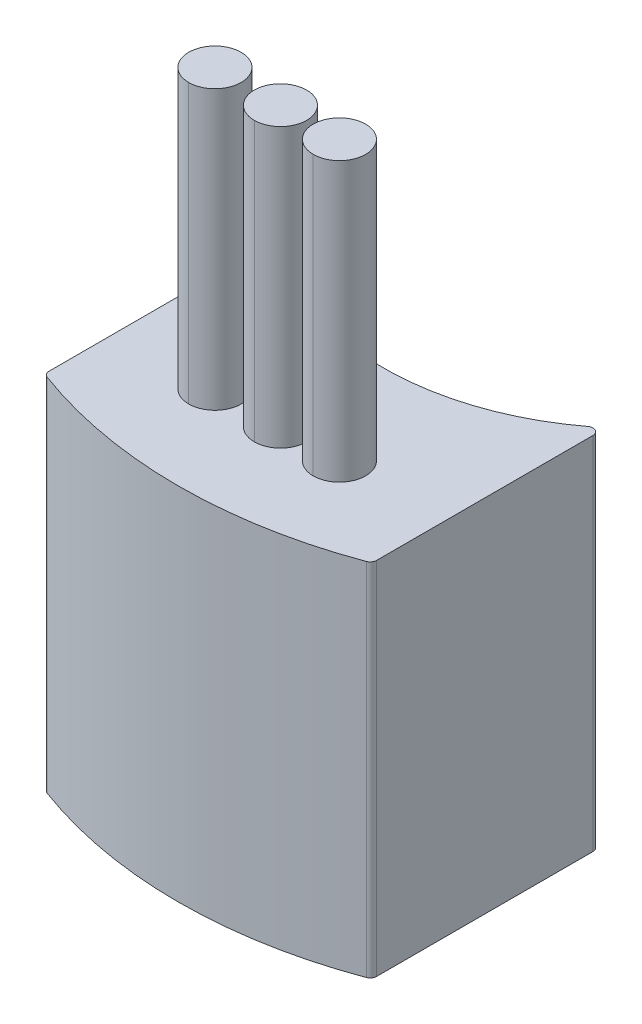
ISO-10303-21;
HEADER;
FILE_DESCRIPTION(('STEP AP214'),'2;1');
FILE_NAME('part.step','',(''),(''),'','','');
FILE_SCHEMA(('AUTOMOTIVE_DESIGN { 1 0 10303 214 1 1 1 1 }'));
ENDSEC;
DATA;
#1=APPLICATION_CONTEXT('core data for automotive mechanical design processes');
#2=APPLICATION_PROTOCOL_DEFINITION('international standard','automotive_design',2000,#1);
#3=PRODUCT_CONTEXT('',#1,'mechanical');
#4=PRODUCT('Part','Part','',(#3));
#5=PRODUCT_RELATED_PRODUCT_CATEGORY('part','',(#4));
#6=PRODUCT_DEFINITION_FORMATION('','',#4);
#7=PRODUCT_DEFINITION_CONTEXT('part definition',#1,'design');
#8=PRODUCT_DEFINITION('design','',#6,#7);
#9=PRODUCT_DEFINITION_SHAPE('','',#8);
#10=(LENGTH_UNIT() NAMED_UNIT(*) SI_UNIT(.MILLI.,.METRE.));
#11=(NAMED_UNIT(*) PLANE_ANGLE_UNIT() SI_UNIT($,.RADIAN.));
#12=(NAMED_UNIT(*) SI_UNIT($,.STERADIAN.) SOLID_ANGLE_UNIT());
#13=UNCERTAINTY_MEASURE_WITH_UNIT(LENGTH_MEASURE(1.E-05),#10,'distance_accuracy_value','');
#14=(GEOMETRIC_REPRESENTATION_CONTEXT(3) GLOBAL_UNCERTAINTY_ASSIGNED_CONTEXT((#13)) GLOBAL_UNIT_ASSIGNED_CONTEXT((#10,
#11,#12)) REPRESENTATION_CONTEXT('',''));
#15=CARTESIAN_POINT('',(0.,0.,0.));
#16=DIRECTION('',(0.,0.,1.));
#17=DIRECTION('',(1.,0.,0.));
#18=AXIS2_PLACEMENT_3D('',#15,#16,#17);
#19=CARTESIAN_POINT('',(-2.,14.,0.));
#20=DIRECTION('',(0.,1.,0.));
#21=DIRECTION('',(1.,0.,0.));
#22=AXIS2_PLACEMENT_3D('',#19,#20,#21);
#23=PLANE('',#22);
#24=CARTESIAN_POINT('',(-2.,14.,0.));
#25=DIRECTION('',(0.,1.,0.));
#26=DIRECTION('',(0.,0.,1.));
#27=AXIS2_PLACEMENT_3D('',#24,#25,#26);
#28=CIRCLE('',#27,0.8);
#29=CARTESIAN_POINT('',(-2.,14.,-0.8));
#30=VERTEX_POINT('',#29);
#31=CARTESIAN_POINT('',(-2.,14.,0.8));
#32=VERTEX_POINT('',#31);
#33=EDGE_CURVE('E11',#30,#32,#28,.T.);
#34=ORIENTED_EDGE('',*,*,#33,.T.);
#35=CARTESIAN_POINT('',(-2.,14.,0.));
#36=DIRECTION('',(0.,1.,0.));
#37=DIRECTION('',(0.,0.,1.));
#38=AXIS2_PLACEMENT_3D('',#35,#36,#37);
#39=CIRCLE('',#38,0.8);
#40=EDGE_CURVE('E229',#32,#30,#39,.T.);
#41=ORIENTED_EDGE('',*,*,#40,.T.);
#42=EDGE_LOOP('',(#34,#41));
#43=FACE_BOUND('',#42,.T.);
#44=ADVANCED_FACE('F16',(#43),#23,.T.);
#45=CARTESIAN_POINT('',(-2.,14.,0.));
#46=DIRECTION('',(0.,-1.,0.));
#47=DIRECTION('',(0.,0.,-1.));
#48=AXIS2_PLACEMENT_3D('',#45,#46,#47);
#49=CYLINDRICAL_SURFACE('',#48,0.8);
#50=DIRECTION('',(0.,-1.,0.));
#51=VECTOR('',#50,1.);
#52=CARTESIAN_POINT('',(-2.,14.,0.8));
#53=LINE('',#52,#51);
#54=CARTESIAN_POINT('',(-2.,5.5,0.8));
#55=VERTEX_POINT('',#54);
#56=EDGE_CURVE('E224',#32,#55,#53,.T.);
#57=ORIENTED_EDGE('',*,*,#56,.F.);
#58=ORIENTED_EDGE('',*,*,#33,.F.);
#59=DIRECTION('',(0.,-1.,0.));
#60=VECTOR('',#59,1.);
#61=CARTESIAN_POINT('',(-2.,14.,-0.8));
#62=LINE('',#61,#60);
#63=CARTESIAN_POINT('',(-2.,5.5,-0.8));
#64=VERTEX_POINT('',#63);
#65=EDGE_CURVE('E230',#30,#64,#62,.T.);
#66=ORIENTED_EDGE('',*,*,#65,.T.);
#67=CARTESIAN_POINT('',(-2.,5.5,0.));
#68=DIRECTION('',(0.,-1.,0.));
#69=DIRECTION('',(0.,0.,1.));
#70=AXIS2_PLACEMENT_3D('',#67,#68,#69);
#71=CIRCLE('',#70,0.8);
#72=EDGE_CURVE('E217',#55,#64,#71,.T.);
#73=ORIENTED_EDGE('',*,*,#72,.F.);
#74=EDGE_LOOP('',(#57,#58,#66,#73));
#75=FACE_BOUND('',#74,.T.);
#76=ADVANCED_FACE('F601',(#75),#49,.T.);
#77=CARTESIAN_POINT('',(1.8,14.,0.));
#78=DIRECTION('',(0.,1.,0.));
#79=DIRECTION('',(1.,0.,0.));
#80=AXIS2_PLACEMENT_3D('',#77,#78,#79);
#81=PLANE('',#80);
#82=CARTESIAN_POINT('',(1.8,14.,0.));
#83=DIRECTION('',(0.,1.,0.));
#84=DIRECTION('',(0.,0.,1.));
#85=AXIS2_PLACEMENT_3D('',#82,#83,#84);
#86=CIRCLE('',#85,0.8);
#87=CARTESIAN_POINT('',(1.8,14.,-0.8));
#88=VERTEX_POINT('',#87);
#89=CARTESIAN_POINT('',(1.8,14.,0.8));
#90=VERTEX_POINT('',#89);
#91=EDGE_CURVE('E27',#88,#90,#86,.T.);
#92=ORIENTED_EDGE('',*,*,#91,.T.);
#93=CARTESIAN_POINT('',(1.8,14.,0.));
#94=DIRECTION('',(0.,1.,0.));
#95=DIRECTION('',(0.,0.,1.));
#96=AXIS2_PLACEMENT_3D('',#93,#94,#95);
#97=CIRCLE('',#96,0.8);
#98=EDGE_CURVE('E234',#90,#88,#97,.T.);
#99=ORIENTED_EDGE('',*,*,#98,.T.);
#100=EDGE_LOOP('',(#92,#99));
#101=FACE_BOUND('',#100,.T.);
#102=ADVANCED_FACE('F606',(#101),#81,.T.);
#103=CARTESIAN_POINT('',(1.8,14.,0.));
#104=DIRECTION('',(0.,-1.,0.));
#105=DIRECTION('',(0.,0.,-1.));
#106=AXIS2_PLACEMENT_3D('',#103,#104,#105);
#107=CYLINDRICAL_SURFACE('',#106,0.8);
#108=DIRECTION('',(0.,-1.,0.));
#109=VECTOR('',#108,1.);
#110=CARTESIAN_POINT('',(1.8,14.,0.8));
#111=LINE('',#110,#109);
#112=CARTESIAN_POINT('',(1.8,5.5,0.8));
#113=VERTEX_POINT('',#112);
#114=EDGE_CURVE('E216',#90,#113,#111,.T.);
#115=ORIENTED_EDGE('',*,*,#114,.F.);
#116=ORIENTED_EDGE('',*,*,#91,.F.);
#117=DIRECTION('',(0.,-1.,0.));
#118=VECTOR('',#117,1.);
#119=CARTESIAN_POINT('',(1.8,14.,-0.8));
#120=LINE('',#119,#118);
#121=CARTESIAN_POINT('',(1.8,5.5,-0.8));
#122=VERTEX_POINT('',#121);
#123=EDGE_CURVE('E215',#88,#122,#120,.T.);
#124=ORIENTED_EDGE('',*,*,#123,.T.);
#125=CARTESIAN_POINT('',(1.8,5.5,0.));
#126=DIRECTION('',(0.,-1.,0.));
#127=DIRECTION('',(0.,0.,1.));
#128=AXIS2_PLACEMENT_3D('',#125,#126,#127);
#129=CIRCLE('',#128,0.8);
#130=EDGE_CURVE('E220',#113,#122,#129,.T.);
#131=ORIENTED_EDGE('',*,*,#130,.F.);
#132=EDGE_LOOP('',(#115,#116,#124,#131));
#133=FACE_BOUND('',#132,.T.);
#134=ADVANCED_FACE('F537',(#133),#107,.T.);
#135=CARTESIAN_POINT('',(0.,14.,0.));
#136=DIRECTION('',(0.,1.,0.));
#137=DIRECTION('',(1.,0.,0.));
#138=AXIS2_PLACEMENT_3D('',#135,#136,#137);
#139=PLANE('',#138);
#140=CARTESIAN_POINT('',(0.,14.,0.));
#141=DIRECTION('',(0.,1.,0.));
#142=DIRECTION('',(0.,0.,1.));
#143=AXIS2_PLACEMENT_3D('',#140,#141,#142);
#144=CIRCLE('',#143,0.8);
#145=CARTESIAN_POINT('',(0.,14.,-0.8));
#146=VERTEX_POINT('',#145);
#147=CARTESIAN_POINT('',(0.,14.,0.8));
#148=VERTEX_POINT('',#147);
#149=EDGE_CURVE('E223',#146,#148,#144,.T.);
#150=ORIENTED_EDGE('',*,*,#149,.T.);
#151=CARTESIAN_POINT('',(0.,14.,0.));
#152=DIRECTION('',(0.,1.,0.));
#153=DIRECTION('',(0.,0.,1.));
#154=AXIS2_PLACEMENT_3D('',#151,#152,#153);
#155=CIRCLE('',#154,0.8);
#156=EDGE_CURVE('E242',#148,#146,#155,.T.);
#157=ORIENTED_EDGE('',*,*,#156,.T.);
#158=EDGE_LOOP('',(#150,#157));
#159=FACE_BOUND('',#158,.T.);
#160=ADVANCED_FACE('F531',(#159),#139,.T.);
#161=CARTESIAN_POINT('',(0.,14.,0.));
#162=DIRECTION('',(0.,-1.,0.));
#163=DIRECTION('',(0.,0.,-1.));
#164=AXIS2_PLACEMENT_3D('',#161,#162,#163);
#165=CYLINDRICAL_SURFACE('',#164,0.8);
#166=DIRECTION('',(0.,-1.,0.));
#167=VECTOR('',#166,1.);
#168=CARTESIAN_POINT('',(0.,14.,0.8));
#169=LINE('',#168,#167);
#170=CARTESIAN_POINT('',(0.,5.5,0.8));
#171=VERTEX_POINT('',#170);
#172=EDGE_CURVE('E239',#148,#171,#169,.T.);
#173=ORIENTED_EDGE('',*,*,#172,.F.);
#174=ORIENTED_EDGE('',*,*,#149,.F.);
#175=DIRECTION('',(0.,-1.,0.));
#176=VECTOR('',#175,1.);
#177=CARTESIAN_POINT('',(0.,14.,-0.8));
#178=LINE('',#177,#176);
#179=CARTESIAN_POINT('',(0.,5.5,-0.8));
#180=VERTEX_POINT('',#179);
#181=EDGE_CURVE('E261',#146,#180,#178,.T.);
#182=ORIENTED_EDGE('',*,*,#181,.T.);
#183=CARTESIAN_POINT('',(0.,5.5,0.));
#184=DIRECTION('',(0.,-1.,0.));
#185=DIRECTION('',(0.,0.,1.));
#186=AXIS2_PLACEMENT_3D('',#183,#184,#185);
#187=CIRCLE('',#186,0.8);
#188=EDGE_CURVE('E294',#171,#180,#187,.T.);
#189=ORIENTED_EDGE('',*,*,#188,.F.);
#190=EDGE_LOOP('',(#173,#174,#182,#189));
#191=FACE_BOUND('',#190,.T.);
#192=ADVANCED_FACE('F536',(#191),#165,.T.);
#193=CARTESIAN_POINT('',(4.8,-5.5,-4.53761094771672));
#194=DIRECTION('',(0.,1.,0.));
#195=DIRECTION('',(1.,0.,0.));
#196=AXIS2_PLACEMENT_3D('',#193,#194,#195);
#197=PLANE('',#196);
#198=CARTESIAN_POINT('',(4.8,-5.5,-4.53761094771672));
#199=DIRECTION('',(0.,1.,0.));
#200=DIRECTION('',(0.,0.,1.));
#201=AXIS2_PLACEMENT_3D('',#198,#199,#200);
#202=CIRCLE('',#201,0.200000000000003);
#203=CARTESIAN_POINT('',(5.,-5.5,-4.53761094771672));
#204=VERTEX_POINT('',#203);
#205=CARTESIAN_POINT('',(4.8,-5.5,-4.73761094771672));
#206=VERTEX_POINT('',#205);
#207=EDGE_CURVE('E274',#204,#206,#202,.T.);
#208=ORIENTED_EDGE('',*,*,#207,.F.);
#209=DIRECTION('',(0.,0.,-1.));
#210=VECTOR('',#209,1.);
#211=CARTESIAN_POINT('',(5.,-5.5,2.06331519170869));
#212=LINE('',#211,#210);
#213=CARTESIAN_POINT('',(5.,-5.5,2.06331519170869));
#214=VERTEX_POINT('',#213);
#215=EDGE_CURVE('E245',#214,#204,#212,.T.);
#216=ORIENTED_EDGE('',*,*,#215,.F.);
#217=CARTESIAN_POINT('',(4.8,-5.5,2.06331519170869));
#218=DIRECTION('',(0.,1.,0.));
#219=DIRECTION('',(0.,0.,1.));
#220=AXIS2_PLACEMENT_3D('',#217,#218,#219);
#221=CIRCLE('',#220,0.2);
#222=CARTESIAN_POINT('',(4.8695652173913,-5.5,2.25082700608128));
#223=VERTEX_POINT('',#222);
#224=EDGE_CURVE('E199',#223,#214,#221,.T.);
#225=ORIENTED_EDGE('',*,*,#224,.F.);
#226=CARTESIAN_POINT('',(0.,-5.5,-10.875));
#227=DIRECTION('',(0.,1.,0.));
#228=DIRECTION('',(0.,0.,1.));
#229=AXIS2_PLACEMENT_3D('',#226,#227,#228);
#230=CIRCLE('',#229,14.);
#231=CARTESIAN_POINT('',(-4.86956521739131,-5.5,2.25082700608128));
#232=VERTEX_POINT('',#231);
#233=EDGE_CURVE('E169',#232,#223,#230,.T.);
#234=ORIENTED_EDGE('',*,*,#233,.F.);
#235=CARTESIAN_POINT('',(-4.8,-5.5,2.06331519170869));
#236=DIRECTION('',(0.,1.,0.));
#237=DIRECTION('',(0.,0.,1.));
#238=AXIS2_PLACEMENT_3D('',#235,#236,#237);
#239=CIRCLE('',#238,0.2);
#240=CARTESIAN_POINT('',(-5.,-5.5,2.06331519170869));
#241=VERTEX_POINT('',#240);
#242=EDGE_CURVE('E162',#241,#232,#239,.T.);
#243=ORIENTED_EDGE('',*,*,#242,.F.);
#244=DIRECTION('',(0.,0.,1.));
#245=VECTOR('',#244,1.);
#246=CARTESIAN_POINT('',(-5.,-5.5,-4.53761094771672));
#247=LINE('',#246,#245);
#248=CARTESIAN_POINT('',(-5.,-5.5,-4.53761094771672));
#249=VERTEX_POINT('',#248);
#250=EDGE_CURVE('E167',#249,#241,#247,.T.);
#251=ORIENTED_EDGE('',*,*,#250,.F.);
#252=CARTESIAN_POINT('',(-4.8,-5.5,-4.53761094771672));
#253=DIRECTION('',(0.,1.,0.));
#254=DIRECTION('',(0.,0.,1.));
#255=AXIS2_PLACEMENT_3D('',#252,#253,#254);
#256=CIRCLE('',#255,0.2);
#257=CARTESIAN_POINT('',(-4.8,-5.5,-4.73761094771672));
#258=VERTEX_POINT('',#257);
#259=EDGE_CURVE('E238',#258,#249,#256,.T.);
#260=ORIENTED_EDGE('',*,*,#259,.F.);
#261=CARTESIAN_POINT('',(-4.8,-5.5,-4.53761094771672));
#262=DIRECTION('',(0.,1.,0.));
#263=DIRECTION('',(0.,0.,1.));
#264=AXIS2_PLACEMENT_3D('',#261,#262,#263);
#265=CIRCLE('',#264,0.2);
#266=CARTESIAN_POINT('',(-4.67924528301886,-5.5,-4.69704211884334));
#267=VERTEX_POINT('',#266);
#268=EDGE_CURVE('E153',#267,#258,#265,.T.);
#269=ORIENTED_EDGE('',*,*,#268,.F.);
#270=CARTESIAN_POINT('',(0.,-5.5,-10.875));
#271=DIRECTION('',(0.,-1.,0.));
#272=DIRECTION('',(0.,0.,1.));
#273=AXIS2_PLACEMENT_3D('',#270,#271,#272);
#274=CIRCLE('',#273,7.75);
#275=CARTESIAN_POINT('',(4.67924528301887,-5.5,-4.69704211884334));
#276=VERTEX_POINT('',#275);
#277=EDGE_CURVE('E287',#276,#267,#274,.T.);
#278=ORIENTED_EDGE('',*,*,#277,.F.);
#279=CARTESIAN_POINT('',(4.8,-5.5,-4.53761094771672));
#280=DIRECTION('',(0.,1.,0.));
#281=DIRECTION('',(0.,0.,1.));
#282=AXIS2_PLACEMENT_3D('',#279,#280,#281);
#283=CIRCLE('',#282,0.200000000000003);
#284=EDGE_CURVE('E201',#206,#276,#283,.T.);
#285=ORIENTED_EDGE('',*,*,#284,.F.);
#286=EDGE_LOOP('',(#208,#216,#225,#234,#243,#251,#260,#269,#278,#285));
#287=FACE_BOUND('',#286,.T.);
#288=ADVANCED_FACE('F165',(#287),#197,.F.);
#289=CARTESIAN_POINT('',(4.8,5.5,-4.53761094771672));
#290=DIRECTION('',(0.,1.,0.));
#291=DIRECTION('',(1.,0.,0.));
#292=AXIS2_PLACEMENT_3D('',#289,#290,#291);
#293=PLANE('',#292);
#294=CARTESIAN_POINT('',(0.,5.5,0.));
#295=DIRECTION('',(0.,-1.,0.));
#296=DIRECTION('',(0.,0.,1.));
#297=AXIS2_PLACEMENT_3D('',#294,#295,#296);
#298=CIRCLE('',#297,0.8);
#299=EDGE_CURVE('E20',#180,#171,#298,.T.);
#300=ORIENTED_EDGE('',*,*,#299,.T.);
#301=ORIENTED_EDGE('',*,*,#188,.T.);
#302=EDGE_LOOP('',(#300,#301));
#303=FACE_BOUND('',#302,.T.);
#304=CARTESIAN_POINT('',(1.8,5.5,0.));
#305=DIRECTION('',(0.,-1.,0.));
#306=DIRECTION('',(0.,0.,1.));
#307=AXIS2_PLACEMENT_3D('',#304,#305,#306);
#308=CIRCLE('',#307,0.8);
#309=EDGE_CURVE('E211',#122,#113,#308,.T.);
#310=ORIENTED_EDGE('',*,*,#309,.T.);
#311=ORIENTED_EDGE('',*,*,#130,.T.);
#312=EDGE_LOOP('',(#310,#311));
#313=FACE_BOUND('',#312,.T.);
#314=CARTESIAN_POINT('',(-2.,5.5,0.));
#315=DIRECTION('',(0.,-1.,0.));
#316=DIRECTION('',(0.,0.,1.));
#317=AXIS2_PLACEMENT_3D('',#314,#315,#316);
#318=CIRCLE('',#317,0.8);
#319=EDGE_CURVE('E228',#64,#55,#318,.T.);
#320=ORIENTED_EDGE('',*,*,#319,.T.);
#321=ORIENTED_EDGE('',*,*,#72,.T.);
#322=EDGE_LOOP('',(#320,#321));
#323=FACE_BOUND('',#322,.T.);
#324=CARTESIAN_POINT('',(4.8,5.5,-4.53761094771672));
#325=DIRECTION('',(0.,1.,0.));
#326=DIRECTION('',(0.,0.,1.));
#327=AXIS2_PLACEMENT_3D('',#324,#325,#326);
#328=CIRCLE('',#327,0.200000000000003);
#329=CARTESIAN_POINT('',(5.,5.5,-4.53761094771672));
#330=VERTEX_POINT('',#329);
#331=CARTESIAN_POINT('',(4.8,5.5,-4.73761094771672));
#332=VERTEX_POINT('',#331);
#333=EDGE_CURVE('E269',#330,#332,#328,.T.);
#334=ORIENTED_EDGE('',*,*,#333,.T.);
#335=CARTESIAN_POINT('',(4.8,5.5,-4.53761094771672));
#336=DIRECTION('',(0.,1.,0.));
#337=DIRECTION('',(0.,0.,1.));
#338=AXIS2_PLACEMENT_3D('',#335,#336,#337);
#339=CIRCLE('',#338,0.200000000000003);
#340=CARTESIAN_POINT('',(4.67924528301887,5.5,-4.69704211884334));
#341=VERTEX_POINT('',#340);
#342=EDGE_CURVE('E237',#332,#341,#339,.T.);
#343=ORIENTED_EDGE('',*,*,#342,.T.);
#344=CARTESIAN_POINT('',(0.,5.5,-10.875));
#345=DIRECTION('',(0.,-1.,0.));
#346=DIRECTION('',(0.,0.,1.));
#347=AXIS2_PLACEMENT_3D('',#344,#345,#346);
#348=CIRCLE('',#347,7.75);
#349=CARTESIAN_POINT('',(-4.67924528301886,5.5,-4.69704211884334));
#350=VERTEX_POINT('',#349);
#351=EDGE_CURVE('E277',#341,#350,#348,.T.);
#352=ORIENTED_EDGE('',*,*,#351,.T.);
#353=CARTESIAN_POINT('',(-4.8,5.5,-4.53761094771672));
#354=DIRECTION('',(0.,1.,0.));
#355=DIRECTION('',(0.,0.,1.));
#356=AXIS2_PLACEMENT_3D('',#353,#354,#355);
#357=CIRCLE('',#356,0.2);
#358=CARTESIAN_POINT('',(-4.8,5.5,-4.73761094771672));
#359=VERTEX_POINT('',#358);
#360=EDGE_CURVE('E191',#350,#359,#357,.T.);
#361=ORIENTED_EDGE('',*,*,#360,.T.);
#362=CARTESIAN_POINT('',(-4.8,5.5,-4.53761094771672));
#363=DIRECTION('',(0.,1.,0.));
#364=DIRECTION('',(0.,0.,1.));
#365=AXIS2_PLACEMENT_3D('',#362,#363,#364);
#366=CIRCLE('',#365,0.2);
#367=CARTESIAN_POINT('',(-5.,5.5,-4.53761094771672));
#368=VERTEX_POINT('',#367);
#369=EDGE_CURVE('E265',#359,#368,#366,.T.);
#370=ORIENTED_EDGE('',*,*,#369,.T.);
#371=DIRECTION('',(0.,0.,1.));
#372=VECTOR('',#371,1.);
#373=CARTESIAN_POINT('',(-5.,5.5,-4.53761094771672));
#374=LINE('',#373,#372);
#375=CARTESIAN_POINT('',(-5.,5.5,2.06331519170869));
#376=VERTEX_POINT('',#375);
#377=EDGE_CURVE('E140',#368,#376,#374,.T.);
#378=ORIENTED_EDGE('',*,*,#377,.T.);
#379=CARTESIAN_POINT('',(-4.8,5.5,2.06331519170869));
#380=DIRECTION('',(0.,1.,0.));
#381=DIRECTION('',(0.,0.,1.));
#382=AXIS2_PLACEMENT_3D('',#379,#380,#381);
#383=CIRCLE('',#382,0.2);
#384=CARTESIAN_POINT('',(-4.86956521739131,5.5,2.25082700608128));
#385=VERTEX_POINT('',#384);
#386=EDGE_CURVE('E179',#376,#385,#383,.T.);
#387=ORIENTED_EDGE('',*,*,#386,.T.);
#388=CARTESIAN_POINT('',(0.,5.5,-10.875));
#389=DIRECTION('',(0.,1.,0.));
#390=DIRECTION('',(0.,0.,1.));
#391=AXIS2_PLACEMENT_3D('',#388,#389,#390);
#392=CIRCLE('',#391,14.);
#393=CARTESIAN_POINT('',(4.8695652173913,5.5,2.25082700608128));
#394=VERTEX_POINT('',#393);
#395=EDGE_CURVE('E195',#385,#394,#392,.T.);
#396=ORIENTED_EDGE('',*,*,#395,.T.);
#397=CARTESIAN_POINT('',(4.8,5.5,2.06331519170869));
#398=DIRECTION('',(0.,1.,0.));
#399=DIRECTION('',(0.,0.,1.));
#400=AXIS2_PLACEMENT_3D('',#397,#398,#399);
#401=CIRCLE('',#400,0.2);
#402=CARTESIAN_POINT('',(5.,5.5,2.06331519170869));
#403=VERTEX_POINT('',#402);
#404=EDGE_CURVE('E243',#394,#403,#401,.T.);
#405=ORIENTED_EDGE('',*,*,#404,.T.);
#406=DIRECTION('',(0.,0.,-1.));
#407=VECTOR('',#406,1.);
#408=CARTESIAN_POINT('',(5.,5.5,2.06331519170869));
#409=LINE('',#408,#407);
#410=EDGE_CURVE('E42',#403,#330,#409,.T.);
#411=ORIENTED_EDGE('',*,*,#410,.T.);
#412=EDGE_LOOP('',(#334,#343,#352,#361,#370,#378,#387,#396,#405,#411));
#413=FACE_BOUND('',#412,.T.);
#414=ADVANCED_FACE('F346',(#303,#313,#323,#413),#293,.T.);
#415=CARTESIAN_POINT('',(5.,5.5,2.06331519170869));
#416=DIRECTION('',(-1.,0.,0.));
#417=DIRECTION('',(0.,0.,1.));
#418=AXIS2_PLACEMENT_3D('',#415,#416,#417);
#419=PLANE('',#418);
#420=ORIENTED_EDGE('',*,*,#215,.T.);
#421=DIRECTION('',(0.,-1.,0.));
#422=VECTOR('',#421,1.);
#423=CARTESIAN_POINT('',(5.,5.5,-4.53761094771672));
#424=LINE('',#423,#422);
#425=EDGE_CURVE('E270',#330,#204,#424,.T.);
#426=ORIENTED_EDGE('',*,*,#425,.F.);
#427=ORIENTED_EDGE('',*,*,#410,.F.);
#428=DIRECTION('',(0.,-1.,0.));
#429=VECTOR('',#428,1.);
#430=CARTESIAN_POINT('',(5.,5.5,2.06331519170869));
#431=LINE('',#430,#429);
#432=EDGE_CURVE('E210',#403,#214,#431,.T.);
#433=ORIENTED_EDGE('',*,*,#432,.T.);
#434=EDGE_LOOP('',(#420,#426,#427,#433));
#435=FACE_BOUND('',#434,.T.);
#436=ADVANCED_FACE('F18',(#435),#419,.F.);
#437=CARTESIAN_POINT('',(4.8,5.5,2.06331519170869));
#438=DIRECTION('',(0.,-1.,0.));
#439=DIRECTION('',(0.,0.,-1.));
#440=AXIS2_PLACEMENT_3D('',#437,#438,#439);
#441=CYLINDRICAL_SURFACE('',#440,0.2);
#442=ORIENTED_EDGE('',*,*,#224,.T.);
#443=ORIENTED_EDGE('',*,*,#432,.F.);
#444=ORIENTED_EDGE('',*,*,#404,.F.);
#445=DIRECTION('',(0.,-1.,0.));
#446=VECTOR('',#445,1.);
#447=CARTESIAN_POINT('',(4.8695652173913,5.5,2.25082700608128));
#448=LINE('',#447,#446);
#449=EDGE_CURVE('E200',#394,#223,#448,.T.);
#450=ORIENTED_EDGE('',*,*,#449,.T.);
#451=EDGE_LOOP('',(#442,#443,#444,#450));
#452=FACE_BOUND('',#451,.T.);
#453=ADVANCED_FACE('F593',(#452),#441,.T.);
#454=CARTESIAN_POINT('',(0.,5.5,-10.875));
#455=DIRECTION('',(0.,-1.,0.));
#456=DIRECTION('',(0.,0.,-1.));
#457=AXIS2_PLACEMENT_3D('',#454,#455,#456);
#458=CYLINDRICAL_SURFACE('',#457,14.);
#459=ORIENTED_EDGE('',*,*,#233,.T.);
#460=ORIENTED_EDGE('',*,*,#449,.F.);
#461=ORIENTED_EDGE('',*,*,#395,.F.);
#462=DIRECTION('',(0.,-1.,0.));
#463=VECTOR('',#462,1.);
#464=CARTESIAN_POINT('',(-4.86956521739131,5.5,2.25082700608128));
#465=LINE('',#464,#463);
#466=EDGE_CURVE('E174',#385,#232,#465,.T.);
#467=ORIENTED_EDGE('',*,*,#466,.T.);
#468=EDGE_LOOP('',(#459,#460,#461,#467));
#469=FACE_BOUND('',#468,.T.);
#470=ADVANCED_FACE('F323',(#469),#458,.T.);
#471=CARTESIAN_POINT('',(-4.8,5.5,2.06331519170869));
#472=DIRECTION('',(0.,-1.,0.));
#473=DIRECTION('',(0.,0.,-1.));
#474=AXIS2_PLACEMENT_3D('',#471,#472,#473);
#475=CYLINDRICAL_SURFACE('',#474,0.2);
#476=ORIENTED_EDGE('',*,*,#242,.T.);
#477=ORIENTED_EDGE('',*,*,#466,.F.);
#478=ORIENTED_EDGE('',*,*,#386,.F.);
#479=DIRECTION('',(0.,-1.,0.));
#480=VECTOR('',#479,1.);
#481=CARTESIAN_POINT('',(-5.,5.5,2.06331519170869));
#482=LINE('',#481,#480);
#483=EDGE_CURVE('E176',#376,#241,#482,.T.);
#484=ORIENTED_EDGE('',*,*,#483,.T.);
#485=EDGE_LOOP('',(#476,#477,#478,#484));
#486=FACE_BOUND('',#485,.T.);
#487=ADVANCED_FACE('F177',(#486),#475,.T.);
#488=CARTESIAN_POINT('',(-5.,5.5,-4.53761094771672));
#489=DIRECTION('',(1.,0.,0.));
#490=DIRECTION('',(0.,0.,1.));
#491=AXIS2_PLACEMENT_3D('',#488,#489,#490);
#492=PLANE('',#491);
#493=ORIENTED_EDGE('',*,*,#250,.T.);
#494=ORIENTED_EDGE('',*,*,#483,.F.);
#495=ORIENTED_EDGE('',*,*,#377,.F.);
#496=DIRECTION('',(0.,-1.,0.));
#497=VECTOR('',#496,1.);
#498=CARTESIAN_POINT('',(-5.,5.5,-4.53761094771672));
#499=LINE('',#498,#497);
#500=EDGE_CURVE('E183',#368,#249,#499,.T.);
#501=ORIENTED_EDGE('',*,*,#500,.T.);
#502=EDGE_LOOP('',(#493,#494,#495,#501));
#503=FACE_BOUND('',#502,.T.);
#504=ADVANCED_FACE('F182',(#503),#492,.F.);
#505=CARTESIAN_POINT('',(-4.8,5.5,-4.53761094771672));
#506=DIRECTION('',(0.,-1.,0.));
#507=DIRECTION('',(0.,0.,-1.));
#508=AXIS2_PLACEMENT_3D('',#505,#506,#507);
#509=CYLINDRICAL_SURFACE('',#508,0.2);
#510=DIRECTION('',(0.,-1.,0.));
#511=VECTOR('',#510,1.);
#512=CARTESIAN_POINT('',(-4.8,5.5,-4.73761094771672));
#513=LINE('',#512,#511);
#514=EDGE_CURVE('E309',#359,#258,#513,.T.);
#515=ORIENTED_EDGE('',*,*,#514,.F.);
#516=ORIENTED_EDGE('',*,*,#360,.F.);
#517=DIRECTION('',(0.,-1.,0.));
#518=VECTOR('',#517,1.);
#519=CARTESIAN_POINT('',(-4.67924528301886,5.5,-4.69704211884334));
#520=LINE('',#519,#518);
#521=EDGE_CURVE('E259',#350,#267,#520,.T.);
#522=ORIENTED_EDGE('',*,*,#521,.T.);
#523=ORIENTED_EDGE('',*,*,#268,.T.);
#524=EDGE_LOOP('',(#515,#516,#522,#523));
#525=FACE_BOUND('',#524,.T.);
#526=ADVANCED_FACE('F546',(#525),#509,.T.);
#527=CARTESIAN_POINT('',(0.,5.5,-10.875));
#528=DIRECTION('',(0.,-1.,0.));
#529=DIRECTION('',(0.,0.,-1.));
#530=AXIS2_PLACEMENT_3D('',#527,#528,#529);
#531=CYLINDRICAL_SURFACE('',#530,7.75);
#532=ORIENTED_EDGE('',*,*,#277,.T.);
#533=ORIENTED_EDGE('',*,*,#521,.F.);
#534=ORIENTED_EDGE('',*,*,#351,.F.);
#535=DIRECTION('',(0.,-1.,0.));
#536=VECTOR('',#535,1.);
#537=CARTESIAN_POINT('',(4.67924528301887,5.5,-4.69704211884334));
#538=LINE('',#537,#536);
#539=EDGE_CURVE('E204',#341,#276,#538,.T.);
#540=ORIENTED_EDGE('',*,*,#539,.T.);
#541=EDGE_LOOP('',(#532,#533,#534,#540));
#542=FACE_BOUND('',#541,.T.);
#543=ADVANCED_FACE('F352',(#542),#531,.F.);
#544=CARTESIAN_POINT('',(4.8,5.5,-4.53761094771672));
#545=DIRECTION('',(0.,-1.,0.));
#546=DIRECTION('',(0.,0.,-1.));
#547=AXIS2_PLACEMENT_3D('',#544,#545,#546);
#548=CYLINDRICAL_SURFACE('',#547,0.200000000000003);
#549=DIRECTION('',(0.,-1.,0.));
#550=VECTOR('',#549,1.);
#551=CARTESIAN_POINT('',(4.8,5.5,-4.73761094771672));
#552=LINE('',#551,#550);
#553=EDGE_CURVE('E205',#332,#206,#552,.T.);
#554=ORIENTED_EDGE('',*,*,#553,.F.);
#555=ORIENTED_EDGE('',*,*,#333,.F.);
#556=ORIENTED_EDGE('',*,*,#425,.T.);
#557=ORIENTED_EDGE('',*,*,#207,.T.);
#558=EDGE_LOOP('',(#554,#555,#556,#557));
#559=FACE_BOUND('',#558,.T.);
#560=ADVANCED_FACE('F337',(#559),#548,.T.);
#561=CARTESIAN_POINT('',(4.8,5.5,-4.53761094771672));
#562=DIRECTION('',(0.,-1.,0.));
#563=DIRECTION('',(0.,0.,-1.));
#564=AXIS2_PLACEMENT_3D('',#561,#562,#563);
#565=CYLINDRICAL_SURFACE('',#564,0.200000000000003);
#566=ORIENTED_EDGE('',*,*,#342,.F.);
#567=ORIENTED_EDGE('',*,*,#553,.T.);
#568=ORIENTED_EDGE('',*,*,#284,.T.);
#569=ORIENTED_EDGE('',*,*,#539,.F.);
#570=EDGE_LOOP('',(#566,#567,#568,#569));
#571=FACE_BOUND('',#570,.T.);
#572=ADVANCED_FACE('F344',(#571),#565,.T.);
#573=CARTESIAN_POINT('',(-4.8,5.5,-4.53761094771672));
#574=DIRECTION('',(0.,-1.,0.));
#575=DIRECTION('',(0.,0.,-1.));
#576=AXIS2_PLACEMENT_3D('',#573,#574,#575);
#577=CYLINDRICAL_SURFACE('',#576,0.2);
#578=ORIENTED_EDGE('',*,*,#369,.F.);
#579=ORIENTED_EDGE('',*,*,#514,.T.);
#580=ORIENTED_EDGE('',*,*,#259,.T.);
#581=ORIENTED_EDGE('',*,*,#500,.F.);
#582=EDGE_LOOP('',(#578,#579,#580,#581));
#583=FACE_BOUND('',#582,.T.);
#584=ADVANCED_FACE('F571',(#583),#577,.T.);
#585=CARTESIAN_POINT('',(0.,14.,0.));
#586=DIRECTION('',(0.,-1.,0.));
#587=DIRECTION('',(0.,0.,-1.));
#588=AXIS2_PLACEMENT_3D('',#585,#586,#587);
#589=CYLINDRICAL_SURFACE('',#588,0.8);
#590=ORIENTED_EDGE('',*,*,#156,.F.);
#591=ORIENTED_EDGE('',*,*,#172,.T.);
#592=ORIENTED_EDGE('',*,*,#299,.F.);
#593=ORIENTED_EDGE('',*,*,#181,.F.);
#594=EDGE_LOOP('',(#590,#591,#592,#593));
#595=FACE_BOUND('',#594,.T.);
#596=ADVANCED_FACE('F565',(#595),#589,.T.);
#597=CARTESIAN_POINT('',(1.8,14.,0.));
#598=DIRECTION('',(0.,-1.,0.));
#599=DIRECTION('',(0.,0.,-1.));
#600=AXIS2_PLACEMENT_3D('',#597,#598,#599);
#601=CYLINDRICAL_SURFACE('',#600,0.8);
#602=ORIENTED_EDGE('',*,*,#98,.F.);
#603=ORIENTED_EDGE('',*,*,#114,.T.);
#604=ORIENTED_EDGE('',*,*,#309,.F.);
#605=ORIENTED_EDGE('',*,*,#123,.F.);
#606=EDGE_LOOP('',(#602,#603,#604,#605));
#607=FACE_BOUND('',#606,.T.);
#608=ADVANCED_FACE('F570',(#607),#601,.T.);
#609=CARTESIAN_POINT('',(-2.,14.,0.));
#610=DIRECTION('',(0.,-1.,0.));
#611=DIRECTION('',(0.,0.,-1.));
#612=AXIS2_PLACEMENT_3D('',#609,#610,#611);
#613=CYLINDRICAL_SURFACE('',#612,0.8);
#614=ORIENTED_EDGE('',*,*,#40,.F.);
#615=ORIENTED_EDGE('',*,*,#56,.T.);
#616=ORIENTED_EDGE('',*,*,#319,.F.);
#617=ORIENTED_EDGE('',*,*,#65,.F.);
#618=EDGE_LOOP('',(#614,#615,#616,#617));
#619=FACE_BOUND('',#618,.T.);
#620=ADVANCED_FACE('F683',(#619),#613,.T.);
#621=CLOSED_SHELL('',(#44,#76,#102,#134,#160,#192,#288,#414,#436,#453,#470,#487,#504,#526,#543,
#560,#572,#584,#596,#608,#620));
#622=MANIFOLD_SOLID_BREP('B1',#621);
#623=ADVANCED_BREP_SHAPE_REPRESENTATION('',(#18,#622),#14);
#624=SHAPE_DEFINITION_REPRESENTATION(#9,#623);
ENDSEC;
END-ISO-10303-21;
